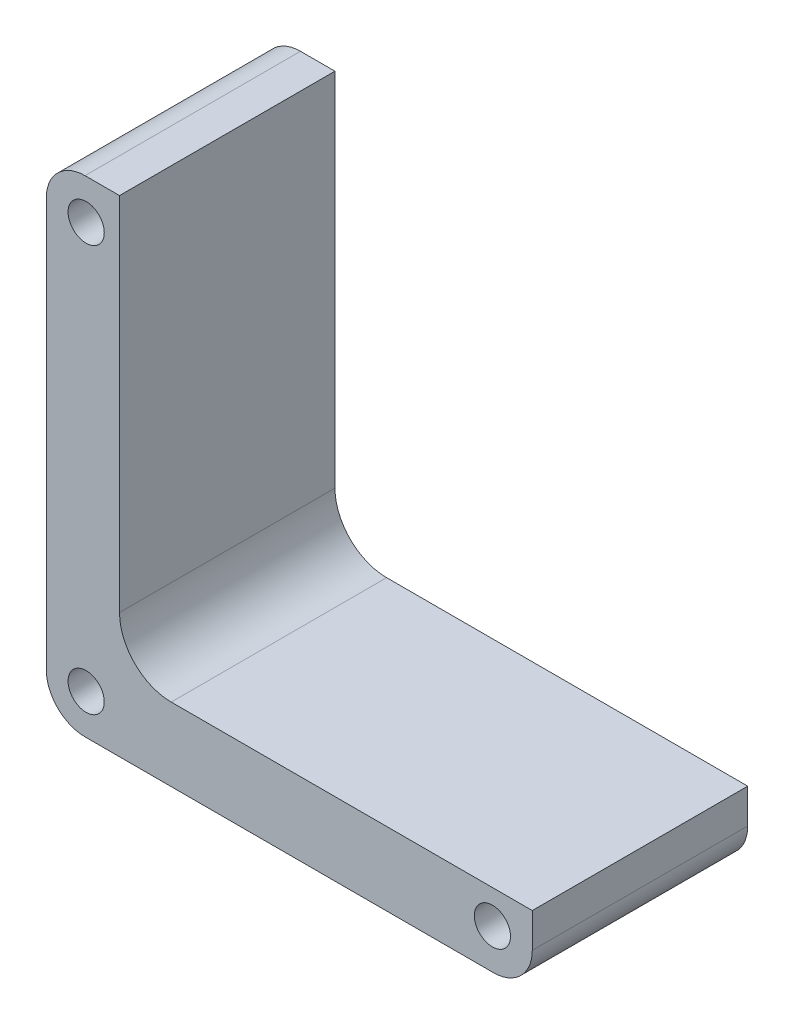
ISO-10303-21;
HEADER;
FILE_DESCRIPTION(('STEP AP214'),'2;1');
FILE_NAME('part.step','',(''),(''),'','','');
FILE_SCHEMA(('AUTOMOTIVE_DESIGN { 1 0 10303 214 1 1 1 1 }'));
ENDSEC;
DATA;
#1=APPLICATION_CONTEXT('core data for automotive mechanical design processes');
#2=APPLICATION_PROTOCOL_DEFINITION('international standard','automotive_design',2000,#1);
#3=PRODUCT_CONTEXT('',#1,'mechanical');
#4=PRODUCT('Part','Part','',(#3));
#5=PRODUCT_RELATED_PRODUCT_CATEGORY('part','',(#4));
#6=PRODUCT_DEFINITION_FORMATION('','',#4);
#7=PRODUCT_DEFINITION_CONTEXT('part definition',#1,'design');
#8=PRODUCT_DEFINITION('design','',#6,#7);
#9=PRODUCT_DEFINITION_SHAPE('','',#8);
#10=(LENGTH_UNIT() NAMED_UNIT(*) SI_UNIT(.MILLI.,.METRE.));
#11=(NAMED_UNIT(*) PLANE_ANGLE_UNIT() SI_UNIT($,.RADIAN.));
#12=(NAMED_UNIT(*) SI_UNIT($,.STERADIAN.) SOLID_ANGLE_UNIT());
#13=UNCERTAINTY_MEASURE_WITH_UNIT(LENGTH_MEASURE(1.E-05),#10,'distance_accuracy_value','');
#14=(GEOMETRIC_REPRESENTATION_CONTEXT(3) GLOBAL_UNCERTAINTY_ASSIGNED_CONTEXT((#13)) GLOBAL_UNIT_ASSIGNED_CONTEXT((#10,
#11,#12)) REPRESENTATION_CONTEXT('',''));
#15=CARTESIAN_POINT('',(0.,0.,0.));
#16=DIRECTION('',(0.,0.,1.));
#17=DIRECTION('',(1.,0.,0.));
#18=AXIS2_PLACEMENT_3D('',#15,#16,#17);
#19=CARTESIAN_POINT('',(0.,0.,0.));
#20=DIRECTION('',(0.,0.,-1.));
#21=DIRECTION('',(-1.,0.,0.));
#22=AXIS2_PLACEMENT_3D('',#19,#20,#21);
#23=PLANE('',#22);
#24=CARTESIAN_POINT('',(-23.57,-23.57,0.));
#25=DIRECTION('',(0.,0.,1.));
#26=DIRECTION('',(1.,0.,0.));
#27=AXIS2_PLACEMENT_3D('',#24,#25,#26);
#28=CIRCLE('',#27,2.09999999999999);
#29=CARTESIAN_POINT('',(-21.47,-23.57,0.));
#30=VERTEX_POINT('',#29);
#31=EDGE_CURVE('E266',#30,#30,#28,.T.);
#32=ORIENTED_EDGE('',*,*,#31,.T.);
#33=EDGE_LOOP('',(#32));
#34=FACE_BOUND('',#33,.T.);
#35=CARTESIAN_POINT('',(23.57,-23.57,0.));
#36=DIRECTION('',(0.,0.,1.));
#37=DIRECTION('',(1.,0.,0.));
#38=AXIS2_PLACEMENT_3D('',#35,#36,#37);
#39=CIRCLE('',#38,2.09999999999999);
#40=CARTESIAN_POINT('',(25.67,-23.57,0.));
#41=VERTEX_POINT('',#40);
#42=EDGE_CURVE('E253',#41,#41,#39,.T.);
#43=ORIENTED_EDGE('',*,*,#42,.T.);
#44=EDGE_LOOP('',(#43));
#45=FACE_BOUND('',#44,.T.);
#46=DIRECTION('',(0.,-1.,0.));
#47=VECTOR('',#46,1.);
#48=CARTESIAN_POINT('',(-28.2,-28.2,0.));
#49=LINE('',#48,#47);
#50=CARTESIAN_POINT('',(-28.2,23.7,0.));
#51=VERTEX_POINT('',#50);
#52=CARTESIAN_POINT('',(-28.2,-23.7,0.));
#53=VERTEX_POINT('',#52);
#54=EDGE_CURVE('E155',#51,#53,#49,.T.);
#55=ORIENTED_EDGE('',*,*,#54,.F.);
#56=CARTESIAN_POINT('',(-23.7,23.7,0.));
#57=DIRECTION('',(0.,0.,-1.));
#58=DIRECTION('',(-1.,0.,0.));
#59=AXIS2_PLACEMENT_3D('',#56,#57,#58);
#60=CIRCLE('',#59,4.5);
#61=CARTESIAN_POINT('',(-23.7,28.2,0.));
#62=VERTEX_POINT('',#61);
#63=EDGE_CURVE('E176',#51,#62,#60,.T.);
#64=ORIENTED_EDGE('',*,*,#63,.T.);
#65=DIRECTION('',(-1.,0.,0.));
#66=VECTOR('',#65,1.);
#67=CARTESIAN_POINT('',(-28.2,28.2,0.));
#68=LINE('',#67,#66);
#69=CARTESIAN_POINT('',(-19.7,28.2,0.));
#70=VERTEX_POINT('',#69);
#71=EDGE_CURVE('E152',#70,#62,#68,.T.);
#72=ORIENTED_EDGE('',*,*,#71,.F.);
#73=DIRECTION('',(0.,1.,0.));
#74=VECTOR('',#73,1.);
#75=CARTESIAN_POINT('',(-19.7,0.,0.));
#76=LINE('',#75,#74);
#77=CARTESIAN_POINT('',(-19.7,-13.7,0.));
#78=VERTEX_POINT('',#77);
#79=EDGE_CURVE('E150',#78,#70,#76,.T.);
#80=ORIENTED_EDGE('',*,*,#79,.F.);
#81=CARTESIAN_POINT('',(-13.7,-13.7,0.));
#82=DIRECTION('',(0.,0.,-1.));
#83=DIRECTION('',(-1.,0.,0.));
#84=AXIS2_PLACEMENT_3D('',#81,#82,#83);
#85=CIRCLE('',#84,6.);
#86=CARTESIAN_POINT('',(-13.7,-19.7,0.));
#87=VERTEX_POINT('',#86);
#88=EDGE_CURVE('E165',#78,#87,#85,.F.);
#89=ORIENTED_EDGE('',*,*,#88,.T.);
#90=DIRECTION('',(1.,0.,0.));
#91=VECTOR('',#90,1.);
#92=CARTESIAN_POINT('',(-19.7,-19.7,0.));
#93=LINE('',#92,#91);
#94=CARTESIAN_POINT('',(28.2,-19.7,0.));
#95=VERTEX_POINT('',#94);
#96=EDGE_CURVE('E130',#87,#95,#93,.T.);
#97=ORIENTED_EDGE('',*,*,#96,.T.);
#98=DIRECTION('',(0.,1.,0.));
#99=VECTOR('',#98,1.);
#100=CARTESIAN_POINT('',(28.2,-28.2,0.));
#101=LINE('',#100,#99);
#102=CARTESIAN_POINT('',(28.2,-23.7,0.));
#103=VERTEX_POINT('',#102);
#104=EDGE_CURVE('E135',#103,#95,#101,.T.);
#105=ORIENTED_EDGE('',*,*,#104,.F.);
#106=CARTESIAN_POINT('',(23.7,-23.7,0.));
#107=DIRECTION('',(0.,0.,-1.));
#108=DIRECTION('',(-1.,0.,0.));
#109=AXIS2_PLACEMENT_3D('',#106,#107,#108);
#110=CIRCLE('',#109,4.5);
#111=CARTESIAN_POINT('',(23.7,-28.2,0.));
#112=VERTEX_POINT('',#111);
#113=EDGE_CURVE('E174',#103,#112,#110,.T.);
#114=ORIENTED_EDGE('',*,*,#113,.T.);
#115=DIRECTION('',(1.,0.,0.));
#116=VECTOR('',#115,1.);
#117=CARTESIAN_POINT('',(-28.2,-28.2,0.));
#118=LINE('',#117,#116);
#119=CARTESIAN_POINT('',(-23.7,-28.2,0.));
#120=VERTEX_POINT('',#119);
#121=EDGE_CURVE('E120',#120,#112,#118,.T.);
#122=ORIENTED_EDGE('',*,*,#121,.F.);
#123=CARTESIAN_POINT('',(-23.7,-23.7,0.));
#124=DIRECTION('',(0.,0.,-1.));
#125=DIRECTION('',(-1.,0.,0.));
#126=AXIS2_PLACEMENT_3D('',#123,#124,#125);
#127=CIRCLE('',#126,4.5);
#128=EDGE_CURVE('E172',#120,#53,#127,.T.);
#129=ORIENTED_EDGE('',*,*,#128,.T.);
#130=EDGE_LOOP('',(#55,#64,#72,#80,#89,#97,#105,#114,#122,#129));
#131=FACE_BOUND('',#130,.T.);
#132=CARTESIAN_POINT('',(-23.57,23.57,0.));
#133=DIRECTION('',(0.,0.,1.));
#134=DIRECTION('',(1.,0.,0.));
#135=AXIS2_PLACEMENT_3D('',#132,#133,#134);
#136=CIRCLE('',#135,2.09999999999999);
#137=CARTESIAN_POINT('',(-21.47,23.57,0.));
#138=VERTEX_POINT('',#137);
#139=EDGE_CURVE('E260',#138,#138,#136,.T.);
#140=ORIENTED_EDGE('',*,*,#139,.T.);
#141=EDGE_LOOP('',(#140));
#142=FACE_BOUND('',#141,.T.);
#143=ADVANCED_FACE('F34',(#34,#45,#131,#142),#23,.T.);
#144=CARTESIAN_POINT('',(0.,0.,25.));
#145=DIRECTION('',(0.,0.,-1.));
#146=DIRECTION('',(-1.,0.,0.));
#147=AXIS2_PLACEMENT_3D('',#144,#145,#146);
#148=PLANE('',#147);
#149=CARTESIAN_POINT('',(-23.57,-23.57,25.));
#150=DIRECTION('',(0.,0.,1.));
#151=DIRECTION('',(1.,0.,0.));
#152=AXIS2_PLACEMENT_3D('',#149,#150,#151);
#153=CIRCLE('',#152,2.1);
#154=CARTESIAN_POINT('',(-21.47,-23.57,25.));
#155=VERTEX_POINT('',#154);
#156=EDGE_CURVE('E268',#155,#155,#153,.T.);
#157=ORIENTED_EDGE('',*,*,#156,.F.);
#158=EDGE_LOOP('',(#157));
#159=FACE_BOUND('',#158,.T.);
#160=CARTESIAN_POINT('',(23.57,-23.57,25.));
#161=DIRECTION('',(0.,0.,1.));
#162=DIRECTION('',(1.,0.,0.));
#163=AXIS2_PLACEMENT_3D('',#160,#161,#162);
#164=CIRCLE('',#163,2.1);
#165=CARTESIAN_POINT('',(25.67,-23.57,25.));
#166=VERTEX_POINT('',#165);
#167=EDGE_CURVE('E255',#166,#166,#164,.T.);
#168=ORIENTED_EDGE('',*,*,#167,.F.);
#169=EDGE_LOOP('',(#168));
#170=FACE_BOUND('',#169,.T.);
#171=DIRECTION('',(-1.,0.,0.));
#172=VECTOR('',#171,1.);
#173=CARTESIAN_POINT('',(-28.2,28.2,25.));
#174=LINE('',#173,#172);
#175=CARTESIAN_POINT('',(-19.7,28.2,25.));
#176=VERTEX_POINT('',#175);
#177=CARTESIAN_POINT('',(-23.7,28.2,25.));
#178=VERTEX_POINT('',#177);
#179=EDGE_CURVE('E119',#176,#178,#174,.T.);
#180=ORIENTED_EDGE('',*,*,#179,.T.);
#181=CARTESIAN_POINT('',(-23.7,23.7,25.));
#182=DIRECTION('',(0.,0.,-1.));
#183=DIRECTION('',(-1.,0.,0.));
#184=AXIS2_PLACEMENT_3D('',#181,#182,#183);
#185=CIRCLE('',#184,4.5);
#186=CARTESIAN_POINT('',(-28.2,23.7,25.));
#187=VERTEX_POINT('',#186);
#188=EDGE_CURVE('E183',#178,#187,#185,.F.);
#189=ORIENTED_EDGE('',*,*,#188,.T.);
#190=DIRECTION('',(0.,-1.,0.));
#191=VECTOR('',#190,1.);
#192=CARTESIAN_POINT('',(-28.2,-28.2,25.));
#193=LINE('',#192,#191);
#194=CARTESIAN_POINT('',(-28.2,-23.7,25.));
#195=VERTEX_POINT('',#194);
#196=EDGE_CURVE('E145',#187,#195,#193,.T.);
#197=ORIENTED_EDGE('',*,*,#196,.T.);
#198=CARTESIAN_POINT('',(-23.7,-23.7,25.));
#199=DIRECTION('',(0.,0.,-1.));
#200=DIRECTION('',(-1.,0.,0.));
#201=AXIS2_PLACEMENT_3D('',#198,#199,#200);
#202=CIRCLE('',#201,4.5);
#203=CARTESIAN_POINT('',(-23.7,-28.2,25.));
#204=VERTEX_POINT('',#203);
#205=EDGE_CURVE('E180',#195,#204,#202,.F.);
#206=ORIENTED_EDGE('',*,*,#205,.T.);
#207=DIRECTION('',(1.,0.,0.));
#208=VECTOR('',#207,1.);
#209=CARTESIAN_POINT('',(-28.2,-28.2,25.));
#210=LINE('',#209,#208);
#211=CARTESIAN_POINT('',(23.7,-28.2,25.));
#212=VERTEX_POINT('',#211);
#213=EDGE_CURVE('E148',#204,#212,#210,.T.);
#214=ORIENTED_EDGE('',*,*,#213,.T.);
#215=CARTESIAN_POINT('',(23.7,-23.7,25.));
#216=DIRECTION('',(0.,0.,-1.));
#217=DIRECTION('',(-1.,0.,0.));
#218=AXIS2_PLACEMENT_3D('',#215,#216,#217);
#219=CIRCLE('',#218,4.5);
#220=CARTESIAN_POINT('',(28.2,-23.7,25.));
#221=VERTEX_POINT('',#220);
#222=EDGE_CURVE('E49',#212,#221,#219,.F.);
#223=ORIENTED_EDGE('',*,*,#222,.T.);
#224=DIRECTION('',(0.,1.,0.));
#225=VECTOR('',#224,1.);
#226=CARTESIAN_POINT('',(28.2,-28.2,25.));
#227=LINE('',#226,#225);
#228=CARTESIAN_POINT('',(28.2,-19.7,25.));
#229=VERTEX_POINT('',#228);
#230=EDGE_CURVE('E109',#221,#229,#227,.T.);
#231=ORIENTED_EDGE('',*,*,#230,.T.);
#232=DIRECTION('',(1.,0.,0.));
#233=VECTOR('',#232,1.);
#234=CARTESIAN_POINT('',(-19.7,-19.7,25.));
#235=LINE('',#234,#233);
#236=CARTESIAN_POINT('',(-13.7,-19.7,25.));
#237=VERTEX_POINT('',#236);
#238=EDGE_CURVE('E114',#237,#229,#235,.T.);
#239=ORIENTED_EDGE('',*,*,#238,.F.);
#240=CARTESIAN_POINT('',(-13.7,-13.7,25.));
#241=DIRECTION('',(0.,0.,-1.));
#242=DIRECTION('',(-1.,0.,0.));
#243=AXIS2_PLACEMENT_3D('',#240,#241,#242);
#244=CIRCLE('',#243,6.);
#245=CARTESIAN_POINT('',(-19.7,-13.7,25.));
#246=VERTEX_POINT('',#245);
#247=EDGE_CURVE('E163',#237,#246,#244,.T.);
#248=ORIENTED_EDGE('',*,*,#247,.T.);
#249=DIRECTION('',(0.,-1.,0.));
#250=VECTOR('',#249,1.);
#251=CARTESIAN_POINT('',(-19.7,-19.7,25.));
#252=LINE('',#251,#250);
#253=EDGE_CURVE('E131',#176,#246,#252,.T.);
#254=ORIENTED_EDGE('',*,*,#253,.F.);
#255=EDGE_LOOP('',(#180,#189,#197,#206,#214,#223,#231,#239,#248,#254));
#256=FACE_BOUND('',#255,.T.);
#257=CARTESIAN_POINT('',(-23.57,23.57,25.));
#258=DIRECTION('',(0.,0.,1.));
#259=DIRECTION('',(1.,0.,0.));
#260=AXIS2_PLACEMENT_3D('',#257,#258,#259);
#261=CIRCLE('',#260,2.1);
#262=CARTESIAN_POINT('',(-21.47,23.57,25.));
#263=VERTEX_POINT('',#262);
#264=EDGE_CURVE('E263',#263,#263,#261,.T.);
#265=ORIENTED_EDGE('',*,*,#264,.F.);
#266=EDGE_LOOP('',(#265));
#267=FACE_BOUND('',#266,.T.);
#268=ADVANCED_FACE('F112',(#159,#170,#256,#267),#148,.F.);
#269=CARTESIAN_POINT('',(28.2,-28.2,25.));
#270=DIRECTION('',(-1.,0.,0.));
#271=DIRECTION('',(0.,0.,1.));
#272=AXIS2_PLACEMENT_3D('',#269,#270,#271);
#273=PLANE('',#272);
#274=ORIENTED_EDGE('',*,*,#230,.F.);
#275=DIRECTION('',(0.,0.,-1.));
#276=VECTOR('',#275,1.);
#277=CARTESIAN_POINT('',(28.2,-23.7,25.));
#278=LINE('',#277,#276);
#279=EDGE_CURVE('E185',#221,#103,#278,.T.);
#280=ORIENTED_EDGE('',*,*,#279,.T.);
#281=ORIENTED_EDGE('',*,*,#104,.T.);
#282=DIRECTION('',(0.,0.,1.));
#283=VECTOR('',#282,1.);
#284=CARTESIAN_POINT('',(28.2,-19.7,25.));
#285=LINE('',#284,#283);
#286=EDGE_CURVE('E127',#95,#229,#285,.T.);
#287=ORIENTED_EDGE('',*,*,#286,.T.);
#288=EDGE_LOOP('',(#274,#280,#281,#287));
#289=FACE_BOUND('',#288,.T.);
#290=ADVANCED_FACE('F133',(#289),#273,.F.);
#291=CARTESIAN_POINT('',(-28.2,28.2,25.));
#292=DIRECTION('',(0.,-1.,0.));
#293=DIRECTION('',(0.,0.,-1.));
#294=AXIS2_PLACEMENT_3D('',#291,#292,#293);
#295=PLANE('',#294);
#296=ORIENTED_EDGE('',*,*,#71,.T.);
#297=DIRECTION('',(0.,0.,-1.));
#298=VECTOR('',#297,1.);
#299=CARTESIAN_POINT('',(-23.7,28.2,25.));
#300=LINE('',#299,#298);
#301=EDGE_CURVE('E178',#62,#178,#300,.F.);
#302=ORIENTED_EDGE('',*,*,#301,.T.);
#303=ORIENTED_EDGE('',*,*,#179,.F.);
#304=DIRECTION('',(0.,0.,-1.));
#305=VECTOR('',#304,1.);
#306=CARTESIAN_POINT('',(-19.7,28.2,25.));
#307=LINE('',#306,#305);
#308=EDGE_CURVE('E137',#176,#70,#307,.T.);
#309=ORIENTED_EDGE('',*,*,#308,.T.);
#310=EDGE_LOOP('',(#296,#302,#303,#309));
#311=FACE_BOUND('',#310,.T.);
#312=ADVANCED_FACE('F224',(#311),#295,.F.);
#313=CARTESIAN_POINT('',(-28.2,-28.2,25.));
#314=DIRECTION('',(1.,0.,0.));
#315=DIRECTION('',(0.,0.,-1.));
#316=AXIS2_PLACEMENT_3D('',#313,#314,#315);
#317=PLANE('',#316);
#318=ORIENTED_EDGE('',*,*,#196,.F.);
#319=DIRECTION('',(0.,0.,-1.));
#320=VECTOR('',#319,1.);
#321=CARTESIAN_POINT('',(-28.2,23.7,25.));
#322=LINE('',#321,#320);
#323=EDGE_CURVE('E169',#187,#51,#322,.T.);
#324=ORIENTED_EDGE('',*,*,#323,.T.);
#325=ORIENTED_EDGE('',*,*,#54,.T.);
#326=DIRECTION('',(0.,0.,-1.));
#327=VECTOR('',#326,1.);
#328=CARTESIAN_POINT('',(-28.2,-23.7,25.));
#329=LINE('',#328,#327);
#330=EDGE_CURVE('E167',#53,#195,#329,.F.);
#331=ORIENTED_EDGE('',*,*,#330,.T.);
#332=EDGE_LOOP('',(#318,#324,#325,#331));
#333=FACE_BOUND('',#332,.T.);
#334=ADVANCED_FACE('F221',(#333),#317,.F.);
#335=CARTESIAN_POINT('',(-28.2,-28.2,25.));
#336=DIRECTION('',(0.,1.,0.));
#337=DIRECTION('',(0.,0.,1.));
#338=AXIS2_PLACEMENT_3D('',#335,#336,#337);
#339=PLANE('',#338);
#340=ORIENTED_EDGE('',*,*,#121,.T.);
#341=DIRECTION('',(0.,0.,-1.));
#342=VECTOR('',#341,1.);
#343=CARTESIAN_POINT('',(23.7,-28.2,25.));
#344=LINE('',#343,#342);
#345=EDGE_CURVE('E11',#112,#212,#344,.F.);
#346=ORIENTED_EDGE('',*,*,#345,.T.);
#347=ORIENTED_EDGE('',*,*,#213,.F.);
#348=DIRECTION('',(0.,0.,-1.));
#349=VECTOR('',#348,1.);
#350=CARTESIAN_POINT('',(-23.7,-28.2,25.));
#351=LINE('',#350,#349);
#352=EDGE_CURVE('E42',#204,#120,#351,.T.);
#353=ORIENTED_EDGE('',*,*,#352,.T.);
#354=EDGE_LOOP('',(#340,#346,#347,#353));
#355=FACE_BOUND('',#354,.T.);
#356=ADVANCED_FACE('F189',(#355),#339,.F.);
#357=CARTESIAN_POINT('',(-19.7,-19.7,0.));
#358=DIRECTION('',(-1.,0.,0.));
#359=DIRECTION('',(0.,0.,1.));
#360=AXIS2_PLACEMENT_3D('',#357,#358,#359);
#361=PLANE('',#360);
#362=ORIENTED_EDGE('',*,*,#253,.T.);
#363=DIRECTION('',(0.,0.,1.));
#364=VECTOR('',#363,1.);
#365=CARTESIAN_POINT('',(-19.7,-13.7,0.));
#366=LINE('',#365,#364);
#367=EDGE_CURVE('E161',#246,#78,#366,.F.);
#368=ORIENTED_EDGE('',*,*,#367,.T.);
#369=ORIENTED_EDGE('',*,*,#79,.T.);
#370=ORIENTED_EDGE('',*,*,#308,.F.);
#371=EDGE_LOOP('',(#362,#368,#369,#370));
#372=FACE_BOUND('',#371,.T.);
#373=ADVANCED_FACE('F220',(#372),#361,.F.);
#374=CARTESIAN_POINT('',(-19.7,-19.7,0.));
#375=DIRECTION('',(0.,-1.,0.));
#376=DIRECTION('',(0.,0.,-1.));
#377=AXIS2_PLACEMENT_3D('',#374,#375,#376);
#378=PLANE('',#377);
#379=ORIENTED_EDGE('',*,*,#96,.F.);
#380=DIRECTION('',(0.,0.,1.));
#381=VECTOR('',#380,1.);
#382=CARTESIAN_POINT('',(-13.7,-19.7,25.));
#383=LINE('',#382,#381);
#384=EDGE_CURVE('E129',#87,#237,#383,.T.);
#385=ORIENTED_EDGE('',*,*,#384,.T.);
#386=ORIENTED_EDGE('',*,*,#238,.T.);
#387=ORIENTED_EDGE('',*,*,#286,.F.);
#388=EDGE_LOOP('',(#379,#385,#386,#387));
#389=FACE_BOUND('',#388,.T.);
#390=ADVANCED_FACE('F126',(#389),#378,.F.);
#391=CARTESIAN_POINT('',(23.57,-23.57,25.));
#392=DIRECTION('',(0.,0.,1.));
#393=DIRECTION('',(1.,0.,0.));
#394=AXIS2_PLACEMENT_3D('',#391,#392,#393);
#395=CYLINDRICAL_SURFACE('',#394,2.1);
#396=ORIENTED_EDGE('',*,*,#42,.F.);
#397=EDGE_LOOP('',(#396));
#398=FACE_BOUND('',#397,.T.);
#399=ORIENTED_EDGE('',*,*,#167,.T.);
#400=EDGE_LOOP('',(#399));
#401=FACE_BOUND('',#400,.T.);
#402=ADVANCED_FACE('F275',(#398,#401),#395,.F.);
#403=CARTESIAN_POINT('',(-23.57,23.57,25.));
#404=DIRECTION('',(0.,0.,1.));
#405=DIRECTION('',(1.,0.,0.));
#406=AXIS2_PLACEMENT_3D('',#403,#404,#405);
#407=CYLINDRICAL_SURFACE('',#406,2.1);
#408=ORIENTED_EDGE('',*,*,#139,.F.);
#409=EDGE_LOOP('',(#408));
#410=FACE_BOUND('',#409,.T.);
#411=ORIENTED_EDGE('',*,*,#264,.T.);
#412=EDGE_LOOP('',(#411));
#413=FACE_BOUND('',#412,.T.);
#414=ADVANCED_FACE('F237',(#410,#413),#407,.F.);
#415=CARTESIAN_POINT('',(-23.57,-23.57,25.));
#416=DIRECTION('',(0.,0.,1.));
#417=DIRECTION('',(1.,0.,0.));
#418=AXIS2_PLACEMENT_3D('',#415,#416,#417);
#419=CYLINDRICAL_SURFACE('',#418,2.1);
#420=ORIENTED_EDGE('',*,*,#31,.F.);
#421=EDGE_LOOP('',(#420));
#422=FACE_BOUND('',#421,.T.);
#423=ORIENTED_EDGE('',*,*,#156,.T.);
#424=EDGE_LOOP('',(#423));
#425=FACE_BOUND('',#424,.T.);
#426=ADVANCED_FACE('F232',(#422,#425),#419,.F.);
#427=CARTESIAN_POINT('',(-13.7,-13.7,0.));
#428=DIRECTION('',(0.,0.,-1.));
#429=DIRECTION('',(-1.,0.,0.));
#430=AXIS2_PLACEMENT_3D('',#427,#428,#429);
#431=CYLINDRICAL_SURFACE('',#430,6.);
#432=ORIENTED_EDGE('',*,*,#88,.F.);
#433=ORIENTED_EDGE('',*,*,#367,.F.);
#434=ORIENTED_EDGE('',*,*,#247,.F.);
#435=ORIENTED_EDGE('',*,*,#384,.F.);
#436=EDGE_LOOP('',(#432,#433,#434,#435));
#437=FACE_BOUND('',#436,.T.);
#438=ADVANCED_FACE('F203',(#437),#431,.F.);
#439=CARTESIAN_POINT('',(-23.7,23.7,25.));
#440=DIRECTION('',(0.,0.,-1.));
#441=DIRECTION('',(-1.,0.,0.));
#442=AXIS2_PLACEMENT_3D('',#439,#440,#441);
#443=CYLINDRICAL_SURFACE('',#442,4.5);
#444=ORIENTED_EDGE('',*,*,#188,.F.);
#445=ORIENTED_EDGE('',*,*,#301,.F.);
#446=ORIENTED_EDGE('',*,*,#63,.F.);
#447=ORIENTED_EDGE('',*,*,#323,.F.);
#448=EDGE_LOOP('',(#444,#445,#446,#447));
#449=FACE_BOUND('',#448,.T.);
#450=ADVANCED_FACE('F198',(#449),#443,.T.);
#451=CARTESIAN_POINT('',(23.7,-23.7,25.));
#452=DIRECTION('',(0.,0.,-1.));
#453=DIRECTION('',(-1.,0.,0.));
#454=AXIS2_PLACEMENT_3D('',#451,#452,#453);
#455=CYLINDRICAL_SURFACE('',#454,4.5);
#456=ORIENTED_EDGE('',*,*,#222,.F.);
#457=ORIENTED_EDGE('',*,*,#345,.F.);
#458=ORIENTED_EDGE('',*,*,#113,.F.);
#459=ORIENTED_EDGE('',*,*,#279,.F.);
#460=EDGE_LOOP('',(#456,#457,#458,#459));
#461=FACE_BOUND('',#460,.T.);
#462=ADVANCED_FACE('F196',(#461),#455,.T.);
#463=CARTESIAN_POINT('',(-23.7,-23.7,25.));
#464=DIRECTION('',(0.,0.,-1.));
#465=DIRECTION('',(-1.,0.,0.));
#466=AXIS2_PLACEMENT_3D('',#463,#464,#465);
#467=CYLINDRICAL_SURFACE('',#466,4.5);
#468=ORIENTED_EDGE('',*,*,#205,.F.);
#469=ORIENTED_EDGE('',*,*,#330,.F.);
#470=ORIENTED_EDGE('',*,*,#128,.F.);
#471=ORIENTED_EDGE('',*,*,#352,.F.);
#472=EDGE_LOOP('',(#468,#469,#470,#471));
#473=FACE_BOUND('',#472,.T.);
#474=ADVANCED_FACE('F36',(#473),#467,.T.);
#475=CLOSED_SHELL('',(#143,#268,#290,#312,#334,#356,#373,#390,#402,#414,#426,#438,#450,#462,#474));
#476=MANIFOLD_SOLID_BREP('B2',#475);
#477=ADVANCED_BREP_SHAPE_REPRESENTATION('',(#18,#476),#14);
#478=SHAPE_DEFINITION_REPRESENTATION(#9,#477);
ENDSEC;
END-ISO-10303-21;
